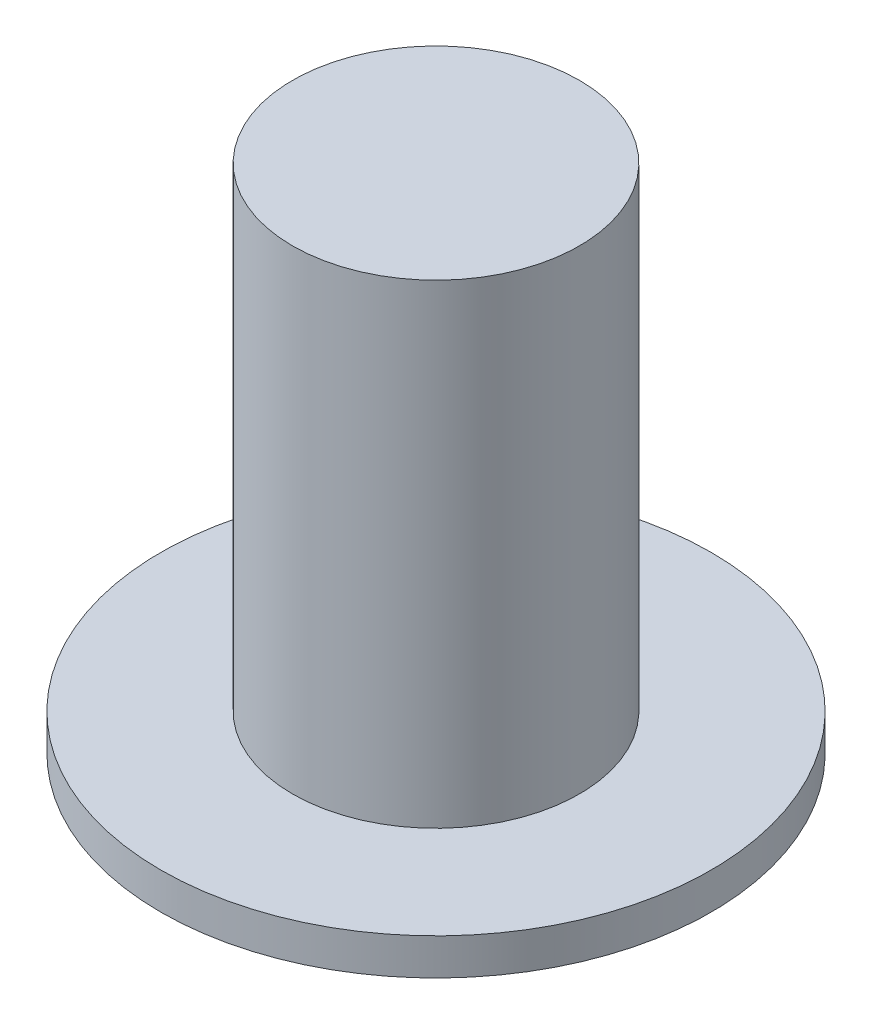
ISO-10303-21;
HEADER;
FILE_DESCRIPTION(('STEP AP214'),'2;1');
FILE_NAME('part.step','',(''),(''),'','','');
FILE_SCHEMA(('AUTOMOTIVE_DESIGN { 1 0 10303 214 1 1 1 1 }'));
ENDSEC;
DATA;
#1=APPLICATION_CONTEXT('core data for automotive mechanical design processes');
#2=APPLICATION_PROTOCOL_DEFINITION('international standard','automotive_design',2000,#1);
#3=PRODUCT_CONTEXT('',#1,'mechanical');
#4=PRODUCT('Part','Part','',(#3));
#5=PRODUCT_RELATED_PRODUCT_CATEGORY('part','',(#4));
#6=PRODUCT_DEFINITION_FORMATION('','',#4);
#7=PRODUCT_DEFINITION_CONTEXT('part definition',#1,'design');
#8=PRODUCT_DEFINITION('design','',#6,#7);
#9=PRODUCT_DEFINITION_SHAPE('','',#8);
#10=(LENGTH_UNIT() NAMED_UNIT(*) SI_UNIT(.MILLI.,.METRE.));
#11=(NAMED_UNIT(*) PLANE_ANGLE_UNIT() SI_UNIT($,.RADIAN.));
#12=(NAMED_UNIT(*) SI_UNIT($,.STERADIAN.) SOLID_ANGLE_UNIT());
#13=UNCERTAINTY_MEASURE_WITH_UNIT(LENGTH_MEASURE(1.E-05),#10,'distance_accuracy_value','');
#14=(GEOMETRIC_REPRESENTATION_CONTEXT(3) GLOBAL_UNCERTAINTY_ASSIGNED_CONTEXT((#13)) GLOBAL_UNIT_ASSIGNED_CONTEXT((#10,
#11,#12)) REPRESENTATION_CONTEXT('',''));
#15=CARTESIAN_POINT('',(0.,0.,0.));
#16=DIRECTION('',(0.,0.,1.));
#17=DIRECTION('',(1.,0.,0.));
#18=AXIS2_PLACEMENT_3D('',#15,#16,#17);
#19=CARTESIAN_POINT('',(0.,-22.,0.));
#20=DIRECTION('',(0.,1.,0.));
#21=DIRECTION('',(0.,0.,1.));
#22=AXIS2_PLACEMENT_3D('',#19,#20,#21);
#23=CYLINDRICAL_SURFACE('',#22,55.);
#24=CARTESIAN_POINT('',(0.,0.,0.));
#25=DIRECTION('',(0.,-1.,0.));
#26=DIRECTION('',(0.,0.,-1.));
#27=AXIS2_PLACEMENT_3D('',#24,#25,#26);
#28=CIRCLE('',#27,55.);
#29=CARTESIAN_POINT('',(0.,0.,-55.));
#30=VERTEX_POINT('',#29);
#31=EDGE_CURVE('E10',#30,#30,#28,.T.);
#32=ORIENTED_EDGE('',*,*,#31,.T.);
#33=EDGE_LOOP('',(#32));
#34=FACE_BOUND('',#33,.T.);
#35=CARTESIAN_POINT('',(0.,-182.,0.));
#36=DIRECTION('',(0.,1.,0.));
#37=DIRECTION('',(0.,0.,1.));
#38=AXIS2_PLACEMENT_3D('',#35,#36,#37);
#39=CIRCLE('',#38,55.);
#40=CARTESIAN_POINT('',(0.,-182.,55.));
#41=VERTEX_POINT('',#40);
#42=EDGE_CURVE('E22',#41,#41,#39,.T.);
#43=ORIENTED_EDGE('',*,*,#42,.T.);
#44=EDGE_LOOP('',(#43));
#45=FACE_BOUND('',#44,.T.);
#46=ADVANCED_FACE('F15',(#34,#45),#23,.T.);
#47=CARTESIAN_POINT('',(0.,0.,0.));
#48=DIRECTION('',(0.,-1.,0.));
#49=DIRECTION('',(0.,0.,-1.));
#50=AXIS2_PLACEMENT_3D('',#47,#48,#49);
#51=PLANE('',#50);
#52=ORIENTED_EDGE('',*,*,#31,.F.);
#53=EDGE_LOOP('',(#52));
#54=FACE_BOUND('',#53,.T.);
#55=ADVANCED_FACE('F55',(#54),#51,.F.);
#56=CARTESIAN_POINT('',(0.,-182.,0.));
#57=DIRECTION('',(0.,1.,0.));
#58=DIRECTION('',(0.,0.,1.));
#59=AXIS2_PLACEMENT_3D('',#56,#57,#58);
#60=PLANE('',#59);
#61=CARTESIAN_POINT('',(0.,-182.,0.));
#62=DIRECTION('',(0.,1.,0.));
#63=DIRECTION('',(0.,0.,-1.));
#64=AXIS2_PLACEMENT_3D('',#61,#62,#63);
#65=CIRCLE('',#64,105.5);
#66=CARTESIAN_POINT('',(0.,-182.,-105.5));
#67=VERTEX_POINT('',#66);
#68=EDGE_CURVE('E33',#67,#67,#65,.T.);
#69=ORIENTED_EDGE('',*,*,#68,.T.);
#70=EDGE_LOOP('',(#69));
#71=FACE_BOUND('',#70,.T.);
#72=ORIENTED_EDGE('',*,*,#42,.F.);
#73=EDGE_LOOP('',(#72));
#74=FACE_BOUND('',#73,.T.);
#75=ADVANCED_FACE('F40',(#71,#74),#60,.T.);
#76=CARTESIAN_POINT('',(0.,-196.,0.));
#77=DIRECTION('',(0.,1.,0.));
#78=DIRECTION('',(0.,0.,1.));
#79=AXIS2_PLACEMENT_3D('',#76,#77,#78);
#80=CYLINDRICAL_SURFACE('',#79,105.5);
#81=CARTESIAN_POINT('',(0.,-196.,0.));
#82=DIRECTION('',(0.,1.,0.));
#83=DIRECTION('',(0.,0.,-1.));
#84=AXIS2_PLACEMENT_3D('',#81,#82,#83);
#85=CIRCLE('',#84,105.5);
#86=CARTESIAN_POINT('',(0.,-196.,-105.5));
#87=VERTEX_POINT('',#86);
#88=EDGE_CURVE('E29',#87,#87,#85,.T.);
#89=ORIENTED_EDGE('',*,*,#88,.T.);
#90=EDGE_LOOP('',(#89));
#91=FACE_BOUND('',#90,.T.);
#92=ORIENTED_EDGE('',*,*,#68,.F.);
#93=EDGE_LOOP('',(#92));
#94=FACE_BOUND('',#93,.T.);
#95=ADVANCED_FACE('F43',(#91,#94),#80,.T.);
#96=CARTESIAN_POINT('',(0.,-196.,0.));
#97=DIRECTION('',(0.,1.,0.));
#98=DIRECTION('',(0.,0.,1.));
#99=AXIS2_PLACEMENT_3D('',#96,#97,#98);
#100=PLANE('',#99);
#101=ORIENTED_EDGE('',*,*,#88,.F.);
#102=EDGE_LOOP('',(#101));
#103=FACE_BOUND('',#102,.T.);
#104=ADVANCED_FACE('F45',(#103),#100,.F.);
#105=CLOSED_SHELL('',(#46,#55,#75,#95,#104));
#106=MANIFOLD_SOLID_BREP('B1',#105);
#107=ADVANCED_BREP_SHAPE_REPRESENTATION('',(#18,#106),#14);
#108=SHAPE_DEFINITION_REPRESENTATION(#9,#107);
ENDSEC;
END-ISO-10303-21;
